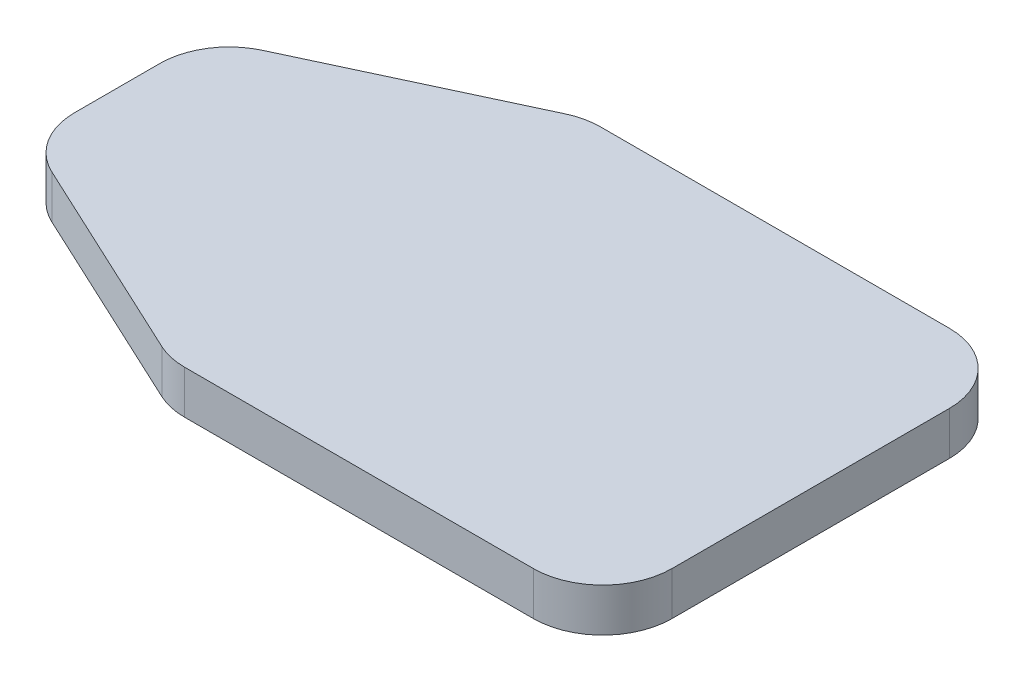
ISO-10303-21;
HEADER;
FILE_DESCRIPTION(('STEP AP214'),'2;1');
FILE_NAME('part.step','',(''),(''),'','','');
FILE_SCHEMA(('AUTOMOTIVE_DESIGN { 1 0 10303 214 1 1 1 1 }'));
ENDSEC;
DATA;
#1=APPLICATION_CONTEXT('core data for automotive mechanical design processes');
#2=APPLICATION_PROTOCOL_DEFINITION('international standard','automotive_design',2000,#1);
#3=PRODUCT_CONTEXT('',#1,'mechanical');
#4=PRODUCT('Part','Part','',(#3));
#5=PRODUCT_RELATED_PRODUCT_CATEGORY('part','',(#4));
#6=PRODUCT_DEFINITION_FORMATION('','',#4);
#7=PRODUCT_DEFINITION_CONTEXT('part definition',#1,'design');
#8=PRODUCT_DEFINITION('design','',#6,#7);
#9=PRODUCT_DEFINITION_SHAPE('','',#8);
#10=(LENGTH_UNIT() NAMED_UNIT(*) SI_UNIT(.MILLI.,.METRE.));
#11=(NAMED_UNIT(*) PLANE_ANGLE_UNIT() SI_UNIT($,.RADIAN.));
#12=(NAMED_UNIT(*) SI_UNIT($,.STERADIAN.) SOLID_ANGLE_UNIT());
#13=UNCERTAINTY_MEASURE_WITH_UNIT(LENGTH_MEASURE(1.E-05),#10,'distance_accuracy_value','');
#14=(GEOMETRIC_REPRESENTATION_CONTEXT(3) GLOBAL_UNCERTAINTY_ASSIGNED_CONTEXT((#13)) GLOBAL_UNIT_ASSIGNED_CONTEXT((#10,
#11,#12)) REPRESENTATION_CONTEXT('',''));
#15=CARTESIAN_POINT('',(0.,0.,0.));
#16=DIRECTION('',(0.,0.,1.));
#17=DIRECTION('',(1.,0.,0.));
#18=AXIS2_PLACEMENT_3D('',#15,#16,#17);
#19=CARTESIAN_POINT('',(-25.4,3.175,0.));
#20=DIRECTION('',(1.,0.,0.));
#21=DIRECTION('',(0.,0.,-1.));
#22=AXIS2_PLACEMENT_3D('',#19,#20,#21);
#23=PLANE('',#22);
#24=DIRECTION('',(0.,0.,1.));
#25=VECTOR('',#24,1.);
#26=CARTESIAN_POINT('',(-25.4,3.175,0.));
#27=LINE('',#26,#25);
#28=CARTESIAN_POINT('',(-25.4,3.175,-3.11473583901241));
#29=VERTEX_POINT('',#28);
#30=CARTESIAN_POINT('',(-25.4,3.175,3.1147358390124));
#31=VERTEX_POINT('',#30);
#32=EDGE_CURVE('E153',#29,#31,#27,.T.);
#33=ORIENTED_EDGE('',*,*,#32,.F.);
#34=DIRECTION('',(0.,-1.,0.));
#35=VECTOR('',#34,1.);
#36=CARTESIAN_POINT('',(-25.4,0.,-3.11473583901241));
#37=LINE('',#36,#35);
#38=CARTESIAN_POINT('',(-25.4,0.,-3.11473583901241));
#39=VERTEX_POINT('',#38);
#40=EDGE_CURVE('E191',#29,#39,#37,.T.);
#41=ORIENTED_EDGE('',*,*,#40,.T.);
#42=DIRECTION('',(0.,0.,1.));
#43=VECTOR('',#42,1.);
#44=CARTESIAN_POINT('',(-25.4,0.,0.));
#45=LINE('',#44,#43);
#46=CARTESIAN_POINT('',(-25.4,0.,3.1147358390124));
#47=VERTEX_POINT('',#46);
#48=EDGE_CURVE('E137',#39,#47,#45,.T.);
#49=ORIENTED_EDGE('',*,*,#48,.T.);
#50=DIRECTION('',(0.,-1.,0.));
#51=VECTOR('',#50,1.);
#52=CARTESIAN_POINT('',(-25.4,3.175,3.1147358390124));
#53=LINE('',#52,#51);
#54=EDGE_CURVE('E189',#47,#31,#53,.F.);
#55=ORIENTED_EDGE('',*,*,#54,.T.);
#56=EDGE_LOOP('',(#33,#41,#49,#55));
#57=FACE_BOUND('',#56,.T.);
#58=ADVANCED_FACE('F41',(#57),#23,.F.);
#59=CARTESIAN_POINT('',(-6.9757299270073,3.175,14.9479927007299));
#60=DIRECTION('',(0.422885465331124,0.,-0.906183139995265));
#61=DIRECTION('',(-0.906183139995265,0.,-0.422885465331124));
#62=AXIS2_PLACEMENT_3D('',#59,#60,#61);
#63=PLANE('',#62);
#64=DIRECTION('',(0.906183139995265,0.,0.422885465331124));
#65=VECTOR('',#64,1.);
#66=CARTESIAN_POINT('',(-6.9757299270073,3.175,14.9479927007299));
#67=LINE('',#66,#65);
#68=CARTESIAN_POINT('',(-22.4682581638821,3.175,7.71814619018835));
#69=VERTEX_POINT('',#68);
#70=CARTESIAN_POINT('',(-7.37126353319441,3.175,14.7634103511759));
#71=VERTEX_POINT('',#70);
#72=EDGE_CURVE('E207',#69,#71,#67,.T.);
#73=ORIENTED_EDGE('',*,*,#72,.F.);
#74=DIRECTION('',(0.,-1.,0.));
#75=VECTOR('',#74,1.);
#76=CARTESIAN_POINT('',(-22.4682581638821,3.175,7.71814619018835));
#77=LINE('',#76,#75);
#78=CARTESIAN_POINT('',(-22.4682581638821,0.,7.71814619018835));
#79=VERTEX_POINT('',#78);
#80=EDGE_CURVE('E11',#69,#79,#77,.T.);
#81=ORIENTED_EDGE('',*,*,#80,.T.);
#82=DIRECTION('',(0.906183139995265,0.,0.422885465331124));
#83=VECTOR('',#82,1.);
#84=CARTESIAN_POINT('',(-6.9757299270073,0.,14.9479927007299));
#85=LINE('',#84,#83);
#86=CARTESIAN_POINT('',(-7.37126353319441,0.,14.7634103511759));
#87=VERTEX_POINT('',#86);
#88=EDGE_CURVE('E210',#79,#87,#85,.T.);
#89=ORIENTED_EDGE('',*,*,#88,.T.);
#90=DIRECTION('',(0.,-1.,0.));
#91=VECTOR('',#90,1.);
#92=CARTESIAN_POINT('',(-7.37126353319441,3.175,14.7634103511759));
#93=LINE('',#92,#91);
#94=EDGE_CURVE('E49',#87,#71,#93,.F.);
#95=ORIENTED_EDGE('',*,*,#94,.T.);
#96=EDGE_LOOP('',(#73,#81,#89,#95));
#97=FACE_BOUND('',#96,.T.);
#98=ADVANCED_FACE('F206',(#97),#63,.F.);
#99=CARTESIAN_POINT('',(0.,3.175,15.24));
#100=DIRECTION('',(0.,0.,-1.));
#101=DIRECTION('',(-1.,0.,0.));
#102=AXIS2_PLACEMENT_3D('',#99,#100,#101);
#103=PLANE('',#102);
#104=DIRECTION('',(1.,0.,0.));
#105=VECTOR('',#104,1.);
#106=CARTESIAN_POINT('',(0.,0.,15.24));
#107=LINE('',#106,#105);
#108=CARTESIAN_POINT('',(-5.2230053693123,0.,15.24));
#109=VERTEX_POINT('',#108);
#110=CARTESIAN_POINT('',(20.32,0.,15.24));
#111=VERTEX_POINT('',#110);
#112=EDGE_CURVE('E225',#109,#111,#107,.T.);
#113=ORIENTED_EDGE('',*,*,#112,.T.);
#114=DIRECTION('',(0.,-1.,0.));
#115=VECTOR('',#114,1.);
#116=CARTESIAN_POINT('',(20.32,3.175,15.24));
#117=LINE('',#116,#115);
#118=CARTESIAN_POINT('',(20.32,3.175,15.24));
#119=VERTEX_POINT('',#118);
#120=EDGE_CURVE('E200',#111,#119,#117,.F.);
#121=ORIENTED_EDGE('',*,*,#120,.T.);
#122=DIRECTION('',(1.,0.,0.));
#123=VECTOR('',#122,1.);
#124=CARTESIAN_POINT('',(0.,3.175,15.24));
#125=LINE('',#124,#123);
#126=CARTESIAN_POINT('',(-5.2230053693123,3.175,15.24));
#127=VERTEX_POINT('',#126);
#128=EDGE_CURVE('E218',#127,#119,#125,.T.);
#129=ORIENTED_EDGE('',*,*,#128,.F.);
#130=DIRECTION('',(0.,-1.,0.));
#131=VECTOR('',#130,1.);
#132=CARTESIAN_POINT('',(-5.2230053693123,3.175,15.24));
#133=LINE('',#132,#131);
#134=EDGE_CURVE('E197',#127,#109,#133,.T.);
#135=ORIENTED_EDGE('',*,*,#134,.T.);
#136=EDGE_LOOP('',(#113,#121,#129,#135));
#137=FACE_BOUND('',#136,.T.);
#138=ADVANCED_FACE('F224',(#137),#103,.F.);
#139=CARTESIAN_POINT('',(25.4,3.175,0.));
#140=DIRECTION('',(1.,0.,0.));
#141=DIRECTION('',(0.,0.,-1.));
#142=AXIS2_PLACEMENT_3D('',#139,#140,#141);
#143=PLANE('',#142);
#144=DIRECTION('',(0.,0.,1.));
#145=VECTOR('',#144,1.);
#146=CARTESIAN_POINT('',(25.4,3.175,0.));
#147=LINE('',#146,#145);
#148=CARTESIAN_POINT('',(25.4,3.175,-10.16));
#149=VERTEX_POINT('',#148);
#150=CARTESIAN_POINT('',(25.4,3.175,10.16));
#151=VERTEX_POINT('',#150);
#152=EDGE_CURVE('E244',#149,#151,#147,.T.);
#153=ORIENTED_EDGE('',*,*,#152,.T.);
#154=DIRECTION('',(0.,-1.,0.));
#155=VECTOR('',#154,1.);
#156=CARTESIAN_POINT('',(25.4,0.,10.16));
#157=LINE('',#156,#155);
#158=CARTESIAN_POINT('',(25.4,0.,10.16));
#159=VERTEX_POINT('',#158);
#160=EDGE_CURVE('E194',#151,#159,#157,.T.);
#161=ORIENTED_EDGE('',*,*,#160,.T.);
#162=DIRECTION('',(0.,0.,1.));
#163=VECTOR('',#162,1.);
#164=CARTESIAN_POINT('',(25.4,0.,0.));
#165=LINE('',#164,#163);
#166=CARTESIAN_POINT('',(25.4,0.,-10.16));
#167=VERTEX_POINT('',#166);
#168=EDGE_CURVE('E228',#167,#159,#165,.T.);
#169=ORIENTED_EDGE('',*,*,#168,.F.);
#170=DIRECTION('',(0.,-1.,0.));
#171=VECTOR('',#170,1.);
#172=CARTESIAN_POINT('',(25.4,3.175,-10.16));
#173=LINE('',#172,#171);
#174=EDGE_CURVE('E63',#167,#149,#173,.F.);
#175=ORIENTED_EDGE('',*,*,#174,.T.);
#176=EDGE_LOOP('',(#153,#161,#169,#175));
#177=FACE_BOUND('',#176,.T.);
#178=ADVANCED_FACE('F279',(#177),#143,.T.);
#179=CARTESIAN_POINT('',(0.,3.175,-15.24));
#180=DIRECTION('',(0.,0.,-1.));
#181=DIRECTION('',(-1.,0.,0.));
#182=AXIS2_PLACEMENT_3D('',#179,#180,#181);
#183=PLANE('',#182);
#184=DIRECTION('',(1.,0.,0.));
#185=VECTOR('',#184,1.);
#186=CARTESIAN_POINT('',(0.,0.,-15.24));
#187=LINE('',#186,#185);
#188=CARTESIAN_POINT('',(-5.2230053693123,0.,-15.24));
#189=VERTEX_POINT('',#188);
#190=CARTESIAN_POINT('',(20.32,0.,-15.24));
#191=VERTEX_POINT('',#190);
#192=EDGE_CURVE('E154',#189,#191,#187,.T.);
#193=ORIENTED_EDGE('',*,*,#192,.F.);
#194=DIRECTION('',(0.,-1.,0.));
#195=VECTOR('',#194,1.);
#196=CARTESIAN_POINT('',(-5.2230053693123,3.175,-15.24));
#197=LINE('',#196,#195);
#198=CARTESIAN_POINT('',(-5.2230053693123,3.175,-15.24));
#199=VERTEX_POINT('',#198);
#200=EDGE_CURVE('E177',#189,#199,#197,.F.);
#201=ORIENTED_EDGE('',*,*,#200,.T.);
#202=DIRECTION('',(1.,0.,0.));
#203=VECTOR('',#202,1.);
#204=CARTESIAN_POINT('',(0.,3.175,-15.24));
#205=LINE('',#204,#203);
#206=CARTESIAN_POINT('',(20.32,3.175,-15.24));
#207=VERTEX_POINT('',#206);
#208=EDGE_CURVE('E163',#199,#207,#205,.T.);
#209=ORIENTED_EDGE('',*,*,#208,.T.);
#210=DIRECTION('',(0.,-1.,0.));
#211=VECTOR('',#210,1.);
#212=CARTESIAN_POINT('',(20.32,3.175,-15.24));
#213=LINE('',#212,#211);
#214=EDGE_CURVE('E174',#207,#191,#213,.T.);
#215=ORIENTED_EDGE('',*,*,#214,.T.);
#216=EDGE_LOOP('',(#193,#201,#209,#215));
#217=FACE_BOUND('',#216,.T.);
#218=ADVANCED_FACE('F237',(#217),#183,.T.);
#219=CARTESIAN_POINT('',(-6.9757299270073,3.175,-14.9479927007299));
#220=DIRECTION('',(-0.422885465331124,0.,-0.906183139995265));
#221=DIRECTION('',(-0.906183139995265,0.,0.422885465331124));
#222=AXIS2_PLACEMENT_3D('',#219,#220,#221);
#223=PLANE('',#222);
#224=DIRECTION('',(0.906183139995265,0.,-0.422885465331124));
#225=VECTOR('',#224,1.);
#226=CARTESIAN_POINT('',(-6.9757299270073,3.175,-14.9479927007299));
#227=LINE('',#226,#225);
#228=CARTESIAN_POINT('',(-22.4682581638821,3.175,-7.71814619018835));
#229=VERTEX_POINT('',#228);
#230=CARTESIAN_POINT('',(-7.37126353319441,3.175,-14.7634103511759));
#231=VERTEX_POINT('',#230);
#232=EDGE_CURVE('E159',#229,#231,#227,.T.);
#233=ORIENTED_EDGE('',*,*,#232,.T.);
#234=DIRECTION('',(0.,-1.,0.));
#235=VECTOR('',#234,1.);
#236=CARTESIAN_POINT('',(-7.37126353319441,3.175,-14.7634103511759));
#237=LINE('',#236,#235);
#238=CARTESIAN_POINT('',(-7.37126353319441,0.,-14.7634103511759));
#239=VERTEX_POINT('',#238);
#240=EDGE_CURVE('E152',#231,#239,#237,.T.);
#241=ORIENTED_EDGE('',*,*,#240,.T.);
#242=DIRECTION('',(0.906183139995265,0.,-0.422885465331124));
#243=VECTOR('',#242,1.);
#244=CARTESIAN_POINT('',(-6.9757299270073,0.,-14.9479927007299));
#245=LINE('',#244,#243);
#246=CARTESIAN_POINT('',(-22.4682581638821,0.,-7.71814619018835));
#247=VERTEX_POINT('',#246);
#248=EDGE_CURVE('E135',#247,#239,#245,.T.);
#249=ORIENTED_EDGE('',*,*,#248,.F.);
#250=DIRECTION('',(0.,-1.,0.));
#251=VECTOR('',#250,1.);
#252=CARTESIAN_POINT('',(-22.4682581638821,3.175,-7.71814619018835));
#253=LINE('',#252,#251);
#254=EDGE_CURVE('E149',#247,#229,#253,.F.);
#255=ORIENTED_EDGE('',*,*,#254,.T.);
#256=EDGE_LOOP('',(#233,#241,#249,#255));
#257=FACE_BOUND('',#256,.T.);
#258=ADVANCED_FACE('F148',(#257),#223,.T.);
#259=CARTESIAN_POINT('',(0.,3.175,0.));
#260=DIRECTION('',(0.,1.,0.));
#261=DIRECTION('',(0.,0.,1.));
#262=AXIS2_PLACEMENT_3D('',#259,#260,#261);
#263=PLANE('',#262);
#264=ORIENTED_EDGE('',*,*,#208,.F.);
#265=CARTESIAN_POINT('',(-5.2230053693123,3.175,-10.16));
#266=DIRECTION('',(0.,1.,0.));
#267=DIRECTION('',(0.,0.,1.));
#268=AXIS2_PLACEMENT_3D('',#265,#266,#267);
#269=CIRCLE('',#268,5.08);
#270=EDGE_CURVE('E187',#199,#231,#269,.T.);
#271=ORIENTED_EDGE('',*,*,#270,.T.);
#272=ORIENTED_EDGE('',*,*,#232,.F.);
#273=CARTESIAN_POINT('',(-20.32,3.175,-3.11473583901241));
#274=DIRECTION('',(0.,1.,0.));
#275=DIRECTION('',(0.,0.,1.));
#276=AXIS2_PLACEMENT_3D('',#273,#274,#275);
#277=CIRCLE('',#276,5.08);
#278=EDGE_CURVE('E158',#229,#29,#277,.T.);
#279=ORIENTED_EDGE('',*,*,#278,.T.);
#280=ORIENTED_EDGE('',*,*,#32,.T.);
#281=CARTESIAN_POINT('',(-20.32,3.175,3.1147358390124));
#282=DIRECTION('',(0.,1.,0.));
#283=DIRECTION('',(0.,0.,1.));
#284=AXIS2_PLACEMENT_3D('',#281,#282,#283);
#285=CIRCLE('',#284,5.08);
#286=EDGE_CURVE('E181',#31,#69,#285,.T.);
#287=ORIENTED_EDGE('',*,*,#286,.T.);
#288=ORIENTED_EDGE('',*,*,#72,.T.);
#289=CARTESIAN_POINT('',(-5.2230053693123,3.175,10.16));
#290=DIRECTION('',(0.,1.,0.));
#291=DIRECTION('',(0.,0.,1.));
#292=AXIS2_PLACEMENT_3D('',#289,#290,#291);
#293=CIRCLE('',#292,5.08);
#294=EDGE_CURVE('E179',#71,#127,#293,.T.);
#295=ORIENTED_EDGE('',*,*,#294,.T.);
#296=ORIENTED_EDGE('',*,*,#128,.T.);
#297=CARTESIAN_POINT('',(20.32,3.175,10.16));
#298=DIRECTION('',(0.,1.,0.));
#299=DIRECTION('',(0.,0.,1.));
#300=AXIS2_PLACEMENT_3D('',#297,#298,#299);
#301=CIRCLE('',#300,5.08);
#302=EDGE_CURVE('E56',#119,#151,#301,.T.);
#303=ORIENTED_EDGE('',*,*,#302,.T.);
#304=ORIENTED_EDGE('',*,*,#152,.F.);
#305=CARTESIAN_POINT('',(20.32,3.175,-10.16));
#306=DIRECTION('',(0.,1.,0.));
#307=DIRECTION('',(0.,0.,1.));
#308=AXIS2_PLACEMENT_3D('',#305,#306,#307);
#309=CIRCLE('',#308,5.08);
#310=EDGE_CURVE('E183',#149,#207,#309,.T.);
#311=ORIENTED_EDGE('',*,*,#310,.T.);
#312=EDGE_LOOP('',(#264,#271,#272,#279,#280,#287,#288,#295,#296,#303,#304,#311));
#313=FACE_BOUND('',#312,.T.);
#314=ADVANCED_FACE('F214',(#313),#263,.T.);
#315=CARTESIAN_POINT('',(0.,0.,0.));
#316=DIRECTION('',(0.,1.,0.));
#317=DIRECTION('',(0.,0.,1.));
#318=AXIS2_PLACEMENT_3D('',#315,#316,#317);
#319=PLANE('',#318);
#320=ORIENTED_EDGE('',*,*,#248,.T.);
#321=CARTESIAN_POINT('',(-5.2230053693123,0.,-10.16));
#322=DIRECTION('',(0.,1.,0.));
#323=DIRECTION('',(0.,0.,1.));
#324=AXIS2_PLACEMENT_3D('',#321,#322,#323);
#325=CIRCLE('',#324,5.08);
#326=EDGE_CURVE('E142',#239,#189,#325,.F.);
#327=ORIENTED_EDGE('',*,*,#326,.T.);
#328=ORIENTED_EDGE('',*,*,#192,.T.);
#329=CARTESIAN_POINT('',(20.32,0.,-10.16));
#330=DIRECTION('',(0.,1.,0.));
#331=DIRECTION('',(0.,0.,1.));
#332=AXIS2_PLACEMENT_3D('',#329,#330,#331);
#333=CIRCLE('',#332,5.08);
#334=EDGE_CURVE('E170',#191,#167,#333,.F.);
#335=ORIENTED_EDGE('',*,*,#334,.T.);
#336=ORIENTED_EDGE('',*,*,#168,.T.);
#337=CARTESIAN_POINT('',(20.32,0.,10.16));
#338=DIRECTION('',(0.,1.,0.));
#339=DIRECTION('',(0.,0.,1.));
#340=AXIS2_PLACEMENT_3D('',#337,#338,#339);
#341=CIRCLE('',#340,5.08);
#342=EDGE_CURVE('E143',#159,#111,#341,.F.);
#343=ORIENTED_EDGE('',*,*,#342,.T.);
#344=ORIENTED_EDGE('',*,*,#112,.F.);
#345=CARTESIAN_POINT('',(-5.2230053693123,0.,10.16));
#346=DIRECTION('',(0.,1.,0.));
#347=DIRECTION('',(0.,0.,1.));
#348=AXIS2_PLACEMENT_3D('',#345,#346,#347);
#349=CIRCLE('',#348,5.08);
#350=EDGE_CURVE('E161',#109,#87,#349,.F.);
#351=ORIENTED_EDGE('',*,*,#350,.T.);
#352=ORIENTED_EDGE('',*,*,#88,.F.);
#353=CARTESIAN_POINT('',(-20.32,0.,3.1147358390124));
#354=DIRECTION('',(0.,1.,0.));
#355=DIRECTION('',(0.,0.,1.));
#356=AXIS2_PLACEMENT_3D('',#353,#354,#355);
#357=CIRCLE('',#356,5.08);
#358=EDGE_CURVE('E168',#79,#47,#357,.F.);
#359=ORIENTED_EDGE('',*,*,#358,.T.);
#360=ORIENTED_EDGE('',*,*,#48,.F.);
#361=CARTESIAN_POINT('',(-20.32,0.,-3.11473583901241));
#362=DIRECTION('',(0.,1.,0.));
#363=DIRECTION('',(0.,0.,1.));
#364=AXIS2_PLACEMENT_3D('',#361,#362,#363);
#365=CIRCLE('',#364,5.08);
#366=EDGE_CURVE('E132',#39,#247,#365,.F.);
#367=ORIENTED_EDGE('',*,*,#366,.T.);
#368=EDGE_LOOP('',(#320,#327,#328,#335,#336,#343,#344,#351,#352,#359,#360,#367));
#369=FACE_BOUND('',#368,.T.);
#370=ADVANCED_FACE('F134',(#369),#319,.F.);
#371=CARTESIAN_POINT('',(-5.2230053693123,3.175,-10.16));
#372=DIRECTION('',(0.,-1.,0.));
#373=DIRECTION('',(0.,0.,-1.));
#374=AXIS2_PLACEMENT_3D('',#371,#372,#373);
#375=CYLINDRICAL_SURFACE('',#374,5.08);
#376=ORIENTED_EDGE('',*,*,#270,.F.);
#377=ORIENTED_EDGE('',*,*,#200,.F.);
#378=ORIENTED_EDGE('',*,*,#326,.F.);
#379=ORIENTED_EDGE('',*,*,#240,.F.);
#380=EDGE_LOOP('',(#376,#377,#378,#379));
#381=FACE_BOUND('',#380,.T.);
#382=ADVANCED_FACE('F242',(#381),#375,.T.);
#383=CARTESIAN_POINT('',(-20.32,3.175,-3.11473583901241));
#384=DIRECTION('',(0.,1.,0.));
#385=DIRECTION('',(0.,0.,1.));
#386=AXIS2_PLACEMENT_3D('',#383,#384,#385);
#387=CYLINDRICAL_SURFACE('',#386,5.08);
#388=ORIENTED_EDGE('',*,*,#278,.F.);
#389=ORIENTED_EDGE('',*,*,#254,.F.);
#390=ORIENTED_EDGE('',*,*,#366,.F.);
#391=ORIENTED_EDGE('',*,*,#40,.F.);
#392=EDGE_LOOP('',(#388,#389,#390,#391));
#393=FACE_BOUND('',#392,.T.);
#394=ADVANCED_FACE('F157',(#393),#387,.T.);
#395=CARTESIAN_POINT('',(20.32,3.175,10.16));
#396=DIRECTION('',(0.,1.,0.));
#397=DIRECTION('',(0.,0.,1.));
#398=AXIS2_PLACEMENT_3D('',#395,#396,#397);
#399=CYLINDRICAL_SURFACE('',#398,5.08);
#400=ORIENTED_EDGE('',*,*,#302,.F.);
#401=ORIENTED_EDGE('',*,*,#120,.F.);
#402=ORIENTED_EDGE('',*,*,#342,.F.);
#403=ORIENTED_EDGE('',*,*,#160,.F.);
#404=EDGE_LOOP('',(#400,#401,#402,#403));
#405=FACE_BOUND('',#404,.T.);
#406=ADVANCED_FACE('F259',(#405),#399,.T.);
#407=CARTESIAN_POINT('',(20.32,3.175,-10.16));
#408=DIRECTION('',(0.,-1.,0.));
#409=DIRECTION('',(0.,0.,-1.));
#410=AXIS2_PLACEMENT_3D('',#407,#408,#409);
#411=CYLINDRICAL_SURFACE('',#410,5.08);
#412=ORIENTED_EDGE('',*,*,#310,.F.);
#413=ORIENTED_EDGE('',*,*,#174,.F.);
#414=ORIENTED_EDGE('',*,*,#334,.F.);
#415=ORIENTED_EDGE('',*,*,#214,.F.);
#416=EDGE_LOOP('',(#412,#413,#414,#415));
#417=FACE_BOUND('',#416,.T.);
#418=ADVANCED_FACE('F254',(#417),#411,.T.);
#419=CARTESIAN_POINT('',(-20.32,3.175,3.1147358390124));
#420=DIRECTION('',(0.,-1.,0.));
#421=DIRECTION('',(0.,0.,-1.));
#422=AXIS2_PLACEMENT_3D('',#419,#420,#421);
#423=CYLINDRICAL_SURFACE('',#422,5.08);
#424=ORIENTED_EDGE('',*,*,#286,.F.);
#425=ORIENTED_EDGE('',*,*,#54,.F.);
#426=ORIENTED_EDGE('',*,*,#358,.F.);
#427=ORIENTED_EDGE('',*,*,#80,.F.);
#428=EDGE_LOOP('',(#424,#425,#426,#427));
#429=FACE_BOUND('',#428,.T.);
#430=ADVANCED_FACE('F252',(#429),#423,.T.);
#431=CARTESIAN_POINT('',(-5.2230053693123,3.175,10.16));
#432=DIRECTION('',(0.,-1.,0.));
#433=DIRECTION('',(0.,0.,-1.));
#434=AXIS2_PLACEMENT_3D('',#431,#432,#433);
#435=CYLINDRICAL_SURFACE('',#434,5.08);
#436=ORIENTED_EDGE('',*,*,#294,.F.);
#437=ORIENTED_EDGE('',*,*,#94,.F.);
#438=ORIENTED_EDGE('',*,*,#350,.F.);
#439=ORIENTED_EDGE('',*,*,#134,.F.);
#440=EDGE_LOOP('',(#436,#437,#438,#439));
#441=FACE_BOUND('',#440,.T.);
#442=ADVANCED_FACE('F43',(#441),#435,.T.);
#443=CLOSED_SHELL('',(#58,#98,#138,#178,#218,#258,#314,#370,#382,#394,#406,#418,#430,#442));
#444=MANIFOLD_SOLID_BREP('B2',#443);
#445=ADVANCED_BREP_SHAPE_REPRESENTATION('',(#18,#444),#14);
#446=SHAPE_DEFINITION_REPRESENTATION(#9,#445);
ENDSEC;
END-ISO-10303-21;
